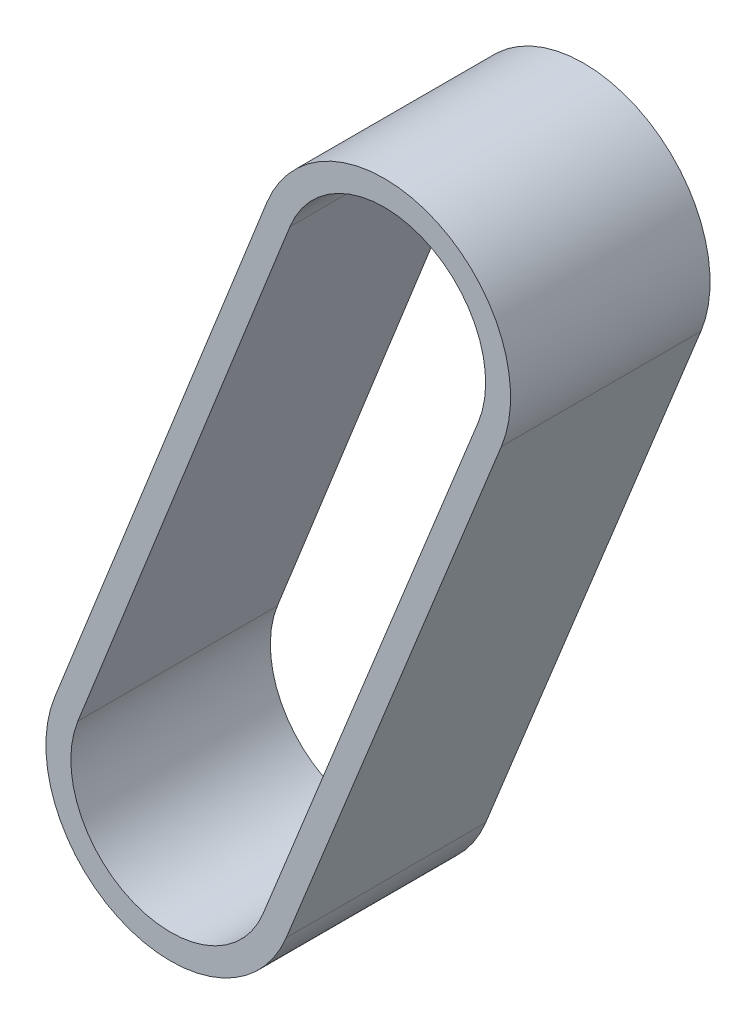
ISO-10303-21;
HEADER;
FILE_DESCRIPTION(('STEP AP214'),'2;1');
FILE_NAME('part.step','',(''),(''),'','','');
FILE_SCHEMA(('AUTOMOTIVE_DESIGN { 1 0 10303 214 1 1 1 1 }'));
ENDSEC;
DATA;
#1=APPLICATION_CONTEXT('core data for automotive mechanical design processes');
#2=APPLICATION_PROTOCOL_DEFINITION('international standard','automotive_design',2000,#1);
#3=PRODUCT_CONTEXT('',#1,'mechanical');
#4=PRODUCT('Part','Part','',(#3));
#5=PRODUCT_RELATED_PRODUCT_CATEGORY('part','',(#4));
#6=PRODUCT_DEFINITION_FORMATION('','',#4);
#7=PRODUCT_DEFINITION_CONTEXT('part definition',#1,'design');
#8=PRODUCT_DEFINITION('design','',#6,#7);
#9=PRODUCT_DEFINITION_SHAPE('','',#8);
#10=(LENGTH_UNIT() NAMED_UNIT(*) SI_UNIT(.MILLI.,.METRE.));
#11=(NAMED_UNIT(*) PLANE_ANGLE_UNIT() SI_UNIT($,.RADIAN.));
#12=(NAMED_UNIT(*) SI_UNIT($,.STERADIAN.) SOLID_ANGLE_UNIT());
#13=UNCERTAINTY_MEASURE_WITH_UNIT(LENGTH_MEASURE(1.E-05),#10,'distance_accuracy_value','');
#14=(GEOMETRIC_REPRESENTATION_CONTEXT(3) GLOBAL_UNCERTAINTY_ASSIGNED_CONTEXT((#13)) GLOBAL_UNIT_ASSIGNED_CONTEXT((#10,
#11,#12)) REPRESENTATION_CONTEXT('',''));
#15=CARTESIAN_POINT('',(0.,0.,0.));
#16=DIRECTION('',(0.,0.,1.));
#17=DIRECTION('',(1.,0.,0.));
#18=AXIS2_PLACEMENT_3D('',#15,#16,#17);
#19=CARTESIAN_POINT('',(-312.556104691908,126.162932863253,-3.00000000000024));
#20=DIRECTION('',(0.927305329792492,-0.374305791216805,0.));
#21=DIRECTION('',(0.374305791216805,0.927305329792492,0.));
#22=AXIS2_PLACEMENT_3D('',#19,#20,#21);
#23=PLANE('',#22);
#24=DIRECTION('',(0.374305791216805,0.927305329792492,0.));
#25=VECTOR('',#24,1.);
#26=CARTESIAN_POINT('',(-312.556104691908,126.162932863253,8.99999999999976));
#27=LINE('',#26,#25);
#28=CARTESIAN_POINT('',(-366.794500886047,-8.2072934341261,8.99999999999976));
#29=VERTEX_POINT('',#28);
#30=CARTESIAN_POINT('',(-353.852479493577,23.8552759867522,8.99999999999976));
#31=VERTEX_POINT('',#30);
#32=EDGE_CURVE('E142',#29,#31,#27,.T.);
#33=ORIENTED_EDGE('',*,*,#32,.F.);
#34=DIRECTION('',(0.,0.,1.));
#35=VECTOR('',#34,1.);
#36=CARTESIAN_POINT('',(-366.794500886047,-8.2072934341261,-3.00000000000024));
#37=LINE('',#36,#35);
#38=CARTESIAN_POINT('',(-366.794500886047,-8.2072934341261,-3.00000000000024));
#39=VERTEX_POINT('',#38);
#40=EDGE_CURVE('E11',#39,#29,#37,.T.);
#41=ORIENTED_EDGE('',*,*,#40,.F.);
#42=DIRECTION('',(0.374305791216805,0.927305329792492,0.));
#43=VECTOR('',#42,1.);
#44=CARTESIAN_POINT('',(-312.556104691908,126.162932863253,-3.00000000000024));
#45=LINE('',#44,#43);
#46=CARTESIAN_POINT('',(-353.852479493577,23.8552759867522,-3.00000000000024));
#47=VERTEX_POINT('',#46);
#48=EDGE_CURVE('E126',#39,#47,#45,.T.);
#49=ORIENTED_EDGE('',*,*,#48,.T.);
#50=DIRECTION('',(0.,0.,1.));
#51=VECTOR('',#50,1.);
#52=CARTESIAN_POINT('',(-353.852479493577,23.8552759867522,-3.00000000000024));
#53=LINE('',#52,#51);
#54=EDGE_CURVE('E117',#47,#31,#53,.T.);
#55=ORIENTED_EDGE('',*,*,#54,.T.);
#56=EDGE_LOOP('',(#33,#41,#49,#55));
#57=FACE_BOUND('',#56,.T.);
#58=ADVANCED_FACE('F36',(#57),#23,.T.);
#59=CARTESIAN_POINT('',(-373.74929085949,-5.40000000000007,-3.00000000000024));
#60=DIRECTION('',(0.,0.,1.));
#61=DIRECTION('',(1.,0.,0.));
#62=AXIS2_PLACEMENT_3D('',#59,#60,#61);
#63=CYLINDRICAL_SURFACE('',#62,7.50000000000001);
#64=CARTESIAN_POINT('',(-373.74929085949,-5.40000000000007,8.99999999999976));
#65=DIRECTION('',(0.,0.,1.));
#66=DIRECTION('',(1.,0.,0.));
#67=AXIS2_PLACEMENT_3D('',#64,#65,#66);
#68=CIRCLE('',#67,7.50000000000001);
#69=CARTESIAN_POINT('',(-380.720202711763,-2.63298212007113,8.99999999999976));
#70=VERTEX_POINT('',#69);
#71=EDGE_CURVE('E148',#70,#29,#68,.T.);
#72=ORIENTED_EDGE('',*,*,#71,.F.);
#73=DIRECTION('',(0.,0.,1.));
#74=VECTOR('',#73,1.);
#75=CARTESIAN_POINT('',(-380.720202711763,-2.63298212007113,-3.00000000000024));
#76=LINE('',#75,#74);
#77=CARTESIAN_POINT('',(-380.720202711763,-2.63298212007113,-3.00000000000024));
#78=VERTEX_POINT('',#77);
#79=EDGE_CURVE('E46',#78,#70,#76,.T.);
#80=ORIENTED_EDGE('',*,*,#79,.F.);
#81=CARTESIAN_POINT('',(-373.74929085949,-5.40000000000007,-3.00000000000024));
#82=DIRECTION('',(0.,0.,1.));
#83=DIRECTION('',(1.,0.,0.));
#84=AXIS2_PLACEMENT_3D('',#81,#82,#83);
#85=CIRCLE('',#84,7.50000000000001);
#86=EDGE_CURVE('E123',#78,#39,#85,.T.);
#87=ORIENTED_EDGE('',*,*,#86,.T.);
#88=ORIENTED_EDGE('',*,*,#40,.T.);
#89=EDGE_LOOP('',(#72,#80,#87,#88));
#90=FACE_BOUND('',#89,.T.);
#91=ADVANCED_FACE('F192',(#90),#63,.T.);
#92=CARTESIAN_POINT('',(-327.996145648299,130.194043303065,-3.00000000000024));
#93=DIRECTION('',(-0.929454913636337,0.368935717323858,0.));
#94=DIRECTION('',(-0.368935717323858,-0.929454913636337,0.));
#95=AXIS2_PLACEMENT_3D('',#92,#93,#94);
#96=PLANE('',#95);
#97=DIRECTION('',(-0.368935717323858,-0.929454913636337,0.));
#98=VECTOR('',#97,1.);
#99=CARTESIAN_POINT('',(-327.996145648299,130.194043303065,8.99999999999976));
#100=LINE('',#99,#98);
#101=CARTESIAN_POINT('',(-367.963857343636,29.5039114516613,8.99999999999976));
#102=VERTEX_POINT('',#101);
#103=EDGE_CURVE('E112',#102,#70,#100,.T.);
#104=ORIENTED_EDGE('',*,*,#103,.F.);
#105=DIRECTION('',(0.,0.,1.));
#106=VECTOR('',#105,1.);
#107=CARTESIAN_POINT('',(-367.963857343636,29.5039114516613,-3.00000000000024));
#108=LINE('',#107,#106);
#109=CARTESIAN_POINT('',(-367.963857343636,29.5039114516613,-3.00000000000024));
#110=VERTEX_POINT('',#109);
#111=EDGE_CURVE('E107',#110,#102,#108,.T.);
#112=ORIENTED_EDGE('',*,*,#111,.F.);
#113=DIRECTION('',(-0.368935717323858,-0.929454913636337,0.));
#114=VECTOR('',#113,1.);
#115=CARTESIAN_POINT('',(-327.996145648299,130.194043303065,-3.00000000000024));
#116=LINE('',#115,#114);
#117=EDGE_CURVE('E110',#110,#78,#116,.T.);
#118=ORIENTED_EDGE('',*,*,#117,.T.);
#119=ORIENTED_EDGE('',*,*,#79,.T.);
#120=EDGE_LOOP('',(#104,#112,#118,#119));
#121=FACE_BOUND('',#120,.T.);
#122=ADVANCED_FACE('F109',(#121),#96,.T.);
#123=CARTESIAN_POINT('',(-373.74929085949,-5.40000000000007,-3.00000000000024));
#124=DIRECTION('',(0.,0.,1.));
#125=DIRECTION('',(1.,0.,0.));
#126=AXIS2_PLACEMENT_3D('',#123,#124,#125);
#127=CYLINDRICAL_SURFACE('',#126,6.00000000000002);
#128=CARTESIAN_POINT('',(-373.74929085949,-5.40000000000007,8.99999999999976));
#129=DIRECTION('',(0.,0.,1.));
#130=DIRECTION('',(1.,0.,0.));
#131=AXIS2_PLACEMENT_3D('',#128,#129,#130);
#132=CIRCLE('',#131,6.00000000000002);
#133=CARTESIAN_POINT('',(-379.326020341309,-3.18638569605689,8.99999999999976));
#134=VERTEX_POINT('',#133);
#135=CARTESIAN_POINT('',(-368.185458880735,-7.64583474730088,8.99999999999976));
#136=VERTEX_POINT('',#135);
#137=EDGE_CURVE('E133',#134,#136,#132,.T.);
#138=ORIENTED_EDGE('',*,*,#137,.T.);
#139=DIRECTION('',(0.,0.,1.));
#140=VECTOR('',#139,1.);
#141=CARTESIAN_POINT('',(-368.185458880735,-7.64583474730088,-3.00000000000024));
#142=LINE('',#141,#140);
#143=CARTESIAN_POINT('',(-368.185458880735,-7.64583474730088,-3.00000000000024));
#144=VERTEX_POINT('',#143);
#145=EDGE_CURVE('E154',#144,#136,#142,.T.);
#146=ORIENTED_EDGE('',*,*,#145,.F.);
#147=CARTESIAN_POINT('',(-373.74929085949,-5.40000000000007,-3.00000000000024));
#148=DIRECTION('',(0.,0.,1.));
#149=DIRECTION('',(1.,0.,0.));
#150=AXIS2_PLACEMENT_3D('',#147,#148,#149);
#151=CIRCLE('',#150,6.00000000000002);
#152=CARTESIAN_POINT('',(-379.326020341309,-3.18638569605689,-3.00000000000024));
#153=VERTEX_POINT('',#152);
#154=EDGE_CURVE('E150',#153,#144,#151,.T.);
#155=ORIENTED_EDGE('',*,*,#154,.F.);
#156=DIRECTION('',(0.,0.,1.));
#157=VECTOR('',#156,1.);
#158=CARTESIAN_POINT('',(-379.326020341309,-3.18638569605689,-3.00000000000024));
#159=LINE('',#158,#157);
#160=EDGE_CURVE('E40',#153,#134,#159,.T.);
#161=ORIENTED_EDGE('',*,*,#160,.T.);
#162=EDGE_LOOP('',(#138,#146,#155,#161));
#163=FACE_BOUND('',#162,.T.);
#164=ADVANCED_FACE('F38',(#163),#127,.F.);
#165=CARTESIAN_POINT('',(-313.947062686597,126.724391550078,-3.00000000000024));
#166=DIRECTION('',(0.927305329792492,-0.374305791216805,0.));
#167=DIRECTION('',(0.374305791216805,0.927305329792492,0.));
#168=AXIS2_PLACEMENT_3D('',#165,#166,#167);
#169=PLANE('',#168);
#170=DIRECTION('',(0.374305791216805,0.927305329792492,0.));
#171=VECTOR('',#170,1.);
#172=CARTESIAN_POINT('',(-313.947062686597,126.724391550078,8.99999999999976));
#173=LINE('',#172,#171);
#174=CARTESIAN_POINT('',(-355.243437488266,24.4167346735775,8.99999999999976));
#175=VERTEX_POINT('',#174);
#176=EDGE_CURVE('E140',#136,#175,#173,.T.);
#177=ORIENTED_EDGE('',*,*,#176,.T.);
#178=DIRECTION('',(0.,0.,1.));
#179=VECTOR('',#178,1.);
#180=CARTESIAN_POINT('',(-355.243437488266,24.4167346735775,-3.00000000000024));
#181=LINE('',#180,#179);
#182=CARTESIAN_POINT('',(-355.243437488266,24.4167346735775,-3.00000000000024));
#183=VERTEX_POINT('',#182);
#184=EDGE_CURVE('E157',#183,#175,#181,.T.);
#185=ORIENTED_EDGE('',*,*,#184,.F.);
#186=DIRECTION('',(0.374305791216805,0.927305329792492,0.));
#187=VECTOR('',#186,1.);
#188=CARTESIAN_POINT('',(-313.947062686597,126.724391550078,-3.00000000000024));
#189=LINE('',#188,#187);
#190=EDGE_CURVE('E128',#144,#183,#189,.T.);
#191=ORIENTED_EDGE('',*,*,#190,.F.);
#192=ORIENTED_EDGE('',*,*,#145,.T.);
#193=EDGE_LOOP('',(#177,#185,#191,#192));
#194=FACE_BOUND('',#193,.T.);
#195=ADVANCED_FACE('F175',(#194),#169,.F.);
#196=CARTESIAN_POINT('',(-360.9,26.6999999999999,-3.00000000000024));
#197=DIRECTION('',(0.,0.,1.));
#198=DIRECTION('',(1.,0.,0.));
#199=AXIS2_PLACEMENT_3D('',#196,#197,#198);
#200=CYLINDRICAL_SURFACE('',#199,6.10000000000002);
#201=CARTESIAN_POINT('',(-360.9,26.6999999999999,8.99999999999976));
#202=DIRECTION('',(0.,0.,1.));
#203=DIRECTION('',(1.,0.,0.));
#204=AXIS2_PLACEMENT_3D('',#201,#202,#203);
#205=CIRCLE('',#204,6.10000000000002);
#206=CARTESIAN_POINT('',(-366.569674973182,28.9505078756755,8.99999999999976));
#207=VERTEX_POINT('',#206);
#208=EDGE_CURVE('E138',#175,#207,#205,.T.);
#209=ORIENTED_EDGE('',*,*,#208,.T.);
#210=DIRECTION('',(0.,0.,1.));
#211=VECTOR('',#210,1.);
#212=CARTESIAN_POINT('',(-366.569674973182,28.9505078756755,-3.00000000000024));
#213=LINE('',#212,#211);
#214=CARTESIAN_POINT('',(-366.569674973182,28.9505078756755,-3.00000000000024));
#215=VERTEX_POINT('',#214);
#216=EDGE_CURVE('E159',#215,#207,#213,.T.);
#217=ORIENTED_EDGE('',*,*,#216,.F.);
#218=CARTESIAN_POINT('',(-360.9,26.6999999999999,-3.00000000000024));
#219=DIRECTION('',(0.,0.,1.));
#220=DIRECTION('',(1.,0.,0.));
#221=AXIS2_PLACEMENT_3D('',#218,#219,#220);
#222=CIRCLE('',#221,6.10000000000002);
#223=EDGE_CURVE('E177',#183,#215,#222,.T.);
#224=ORIENTED_EDGE('',*,*,#223,.F.);
#225=ORIENTED_EDGE('',*,*,#184,.T.);
#226=EDGE_LOOP('',(#209,#217,#224,#225));
#227=FACE_BOUND('',#226,.T.);
#228=ADVANCED_FACE('F182',(#227),#200,.F.);
#229=CARTESIAN_POINT('',(-326.601963277845,129.640639727079,-3.00000000000024));
#230=DIRECTION('',(-0.929454913636337,0.368935717323858,0.));
#231=DIRECTION('',(-0.368935717323858,-0.929454913636337,0.));
#232=AXIS2_PLACEMENT_3D('',#229,#230,#231);
#233=PLANE('',#232);
#234=DIRECTION('',(-0.368935717323858,-0.929454913636337,0.));
#235=VECTOR('',#234,1.);
#236=CARTESIAN_POINT('',(-326.601963277845,129.640639727079,8.99999999999976));
#237=LINE('',#236,#235);
#238=EDGE_CURVE('E136',#207,#134,#237,.T.);
#239=ORIENTED_EDGE('',*,*,#238,.T.);
#240=ORIENTED_EDGE('',*,*,#160,.F.);
#241=DIRECTION('',(-0.368935717323858,-0.929454913636337,0.));
#242=VECTOR('',#241,1.);
#243=CARTESIAN_POINT('',(-326.601963277845,129.640639727079,-3.00000000000024));
#244=LINE('',#243,#242);
#245=EDGE_CURVE('E94',#215,#153,#244,.T.);
#246=ORIENTED_EDGE('',*,*,#245,.F.);
#247=ORIENTED_EDGE('',*,*,#216,.T.);
#248=EDGE_LOOP('',(#239,#240,#246,#247));
#249=FACE_BOUND('',#248,.T.);
#250=ADVANCED_FACE('F183',(#249),#233,.F.);
#251=CARTESIAN_POINT('',(-360.9,26.6999999999999,-3.00000000000024));
#252=DIRECTION('',(0.,0.,1.));
#253=DIRECTION('',(1.,0.,0.));
#254=AXIS2_PLACEMENT_3D('',#251,#252,#253);
#255=CYLINDRICAL_SURFACE('',#254,7.60000000000001);
#256=CARTESIAN_POINT('',(-360.9,26.6999999999999,8.99999999999976));
#257=DIRECTION('',(0.,0.,1.));
#258=DIRECTION('',(1.,0.,0.));
#259=AXIS2_PLACEMENT_3D('',#256,#257,#258);
#260=CIRCLE('',#259,7.60000000000001);
#261=EDGE_CURVE('E145',#31,#102,#260,.T.);
#262=ORIENTED_EDGE('',*,*,#261,.F.);
#263=ORIENTED_EDGE('',*,*,#54,.F.);
#264=CARTESIAN_POINT('',(-360.9,26.6999999999999,-3.00000000000024));
#265=DIRECTION('',(0.,0.,1.));
#266=DIRECTION('',(1.,0.,0.));
#267=AXIS2_PLACEMENT_3D('',#264,#265,#266);
#268=CIRCLE('',#267,7.60000000000001);
#269=EDGE_CURVE('E122',#47,#110,#268,.T.);
#270=ORIENTED_EDGE('',*,*,#269,.T.);
#271=ORIENTED_EDGE('',*,*,#111,.T.);
#272=EDGE_LOOP('',(#262,#263,#270,#271));
#273=FACE_BOUND('',#272,.T.);
#274=ADVANCED_FACE('F125',(#273),#255,.T.);
#275=CARTESIAN_POINT('',(0.,0.,-3.00000000000024));
#276=DIRECTION('',(0.,0.,1.));
#277=DIRECTION('',(1.,0.,0.));
#278=AXIS2_PLACEMENT_3D('',#275,#276,#277);
#279=PLANE('',#278);
#280=ORIENTED_EDGE('',*,*,#154,.T.);
#281=ORIENTED_EDGE('',*,*,#190,.T.);
#282=ORIENTED_EDGE('',*,*,#223,.T.);
#283=ORIENTED_EDGE('',*,*,#245,.T.);
#284=EDGE_LOOP('',(#280,#281,#282,#283));
#285=FACE_BOUND('',#284,.T.);
#286=ORIENTED_EDGE('',*,*,#48,.F.);
#287=ORIENTED_EDGE('',*,*,#86,.F.);
#288=ORIENTED_EDGE('',*,*,#117,.F.);
#289=ORIENTED_EDGE('',*,*,#269,.F.);
#290=EDGE_LOOP('',(#286,#287,#288,#289));
#291=FACE_BOUND('',#290,.T.);
#292=ADVANCED_FACE('F121',(#285,#291),#279,.F.);
#293=CARTESIAN_POINT('',(0.,0.,8.99999999999976));
#294=DIRECTION('',(0.,0.,1.));
#295=DIRECTION('',(1.,0.,0.));
#296=AXIS2_PLACEMENT_3D('',#293,#294,#295);
#297=PLANE('',#296);
#298=ORIENTED_EDGE('',*,*,#137,.F.);
#299=ORIENTED_EDGE('',*,*,#238,.F.);
#300=ORIENTED_EDGE('',*,*,#208,.F.);
#301=ORIENTED_EDGE('',*,*,#176,.F.);
#302=EDGE_LOOP('',(#298,#299,#300,#301));
#303=FACE_BOUND('',#302,.T.);
#304=ORIENTED_EDGE('',*,*,#32,.T.);
#305=ORIENTED_EDGE('',*,*,#261,.T.);
#306=ORIENTED_EDGE('',*,*,#103,.T.);
#307=ORIENTED_EDGE('',*,*,#71,.T.);
#308=EDGE_LOOP('',(#304,#305,#306,#307));
#309=FACE_BOUND('',#308,.T.);
#310=ADVANCED_FACE('F170',(#303,#309),#297,.T.);
#311=CLOSED_SHELL('',(#58,#91,#122,#164,#195,#228,#250,#274,#292,#310));
#312=MANIFOLD_SOLID_BREP('B2',#311);
#313=ADVANCED_BREP_SHAPE_REPRESENTATION('',(#18,#312),#14);
#314=SHAPE_DEFINITION_REPRESENTATION(#9,#313);
ENDSEC;
END-ISO-10303-21;
